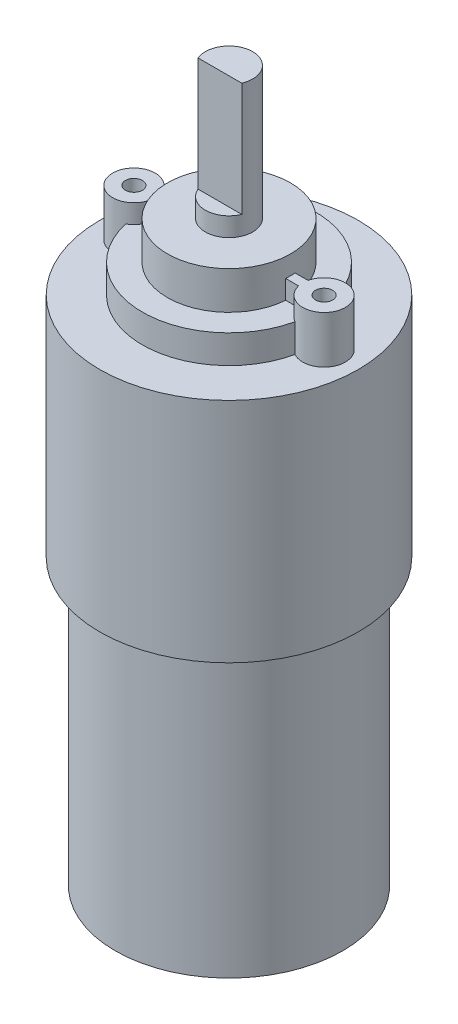
ISO-10303-21;
HEADER;
FILE_DESCRIPTION(('STEP AP214'),'2;1');
FILE_NAME('part.step','',(''),(''),'','','');
FILE_SCHEMA(('AUTOMOTIVE_DESIGN { 1 0 10303 214 1 1 1 1 }'));
ENDSEC;
DATA;
#1=APPLICATION_CONTEXT('core data for automotive mechanical design processes');
#2=APPLICATION_PROTOCOL_DEFINITION('international standard','automotive_design',2000,#1);
#3=PRODUCT_CONTEXT('',#1,'mechanical');
#4=PRODUCT('Part','Part','',(#3));
#5=PRODUCT_RELATED_PRODUCT_CATEGORY('part','',(#4));
#6=PRODUCT_DEFINITION_FORMATION('','',#4);
#7=PRODUCT_DEFINITION_CONTEXT('part definition',#1,'design');
#8=PRODUCT_DEFINITION('design','',#6,#7);
#9=PRODUCT_DEFINITION_SHAPE('','',#8);
#10=(LENGTH_UNIT() NAMED_UNIT(*) SI_UNIT(.MILLI.,.METRE.));
#11=(NAMED_UNIT(*) PLANE_ANGLE_UNIT() SI_UNIT($,.RADIAN.));
#12=(NAMED_UNIT(*) SI_UNIT($,.STERADIAN.) SOLID_ANGLE_UNIT());
#13=UNCERTAINTY_MEASURE_WITH_UNIT(LENGTH_MEASURE(1.E-05),#10,'distance_accuracy_value','');
#14=(GEOMETRIC_REPRESENTATION_CONTEXT(3) GLOBAL_UNCERTAINTY_ASSIGNED_CONTEXT((#13)) GLOBAL_UNIT_ASSIGNED_CONTEXT((#10,
#11,#12)) REPRESENTATION_CONTEXT('',''));
#15=CARTESIAN_POINT('',(0.,0.,0.));
#16=DIRECTION('',(0.,0.,1.));
#17=DIRECTION('',(1.,0.,0.));
#18=AXIS2_PLACEMENT_3D('',#15,#16,#17);
#19=CARTESIAN_POINT('',(0.,26.5,0.));
#20=DIRECTION('',(0.,1.,0.));
#21=DIRECTION('',(0.,0.,-1.));
#22=AXIS2_PLACEMENT_3D('',#19,#20,#21);
#23=PLANE('',#22);
#24=DIRECTION('',(1.,0.,0.));
#25=VECTOR('',#24,1.);
#26=CARTESIAN_POINT('',(0.,26.5,-0.500000000000004));
#27=LINE('',#26,#25);
#28=CARTESIAN_POINT('',(6.48074069840786,26.5,-0.500000000000004));
#29=VERTEX_POINT('',#28);
#30=CARTESIAN_POINT('',(7.84625890315197,26.5,-0.500000000000004));
#31=VERTEX_POINT('',#30);
#32=EDGE_CURVE('E306',#29,#31,#27,.T.);
#33=ORIENTED_EDGE('',*,*,#32,.T.);
#34=CARTESIAN_POINT('',(10.04,26.5,0.));
#35=DIRECTION('',(0.,-1.,0.));
#36=DIRECTION('',(0.,0.,-1.));
#37=AXIS2_PLACEMENT_3D('',#34,#35,#36);
#38=CIRCLE('',#37,2.25);
#39=CARTESIAN_POINT('',(8.93733067729083,26.5,-1.9612802871482));
#40=VERTEX_POINT('',#39);
#41=EDGE_CURVE('E174',#31,#40,#38,.T.);
#42=ORIENTED_EDGE('',*,*,#41,.T.);
#43=CARTESIAN_POINT('',(0.,26.5,0.));
#44=DIRECTION('',(0.,-1.,0.));
#45=DIRECTION('',(0.,0.,-1.));
#46=AXIS2_PLACEMENT_3D('',#43,#44,#45);
#47=CIRCLE('',#46,9.15);
#48=CARTESIAN_POINT('',(-8.93733067729084,26.5,-1.96128028714819));
#49=VERTEX_POINT('',#48);
#50=EDGE_CURVE('E273',#49,#40,#47,.T.);
#51=ORIENTED_EDGE('',*,*,#50,.F.);
#52=CARTESIAN_POINT('',(-10.04,26.5,0.));
#53=DIRECTION('',(0.,-1.,0.));
#54=DIRECTION('',(0.,0.,-1.));
#55=AXIS2_PLACEMENT_3D('',#52,#53,#54);
#56=CIRCLE('',#55,2.25);
#57=CARTESIAN_POINT('',(-7.84625890315197,26.5,-0.500000000000004));
#58=VERTEX_POINT('',#57);
#59=EDGE_CURVE('E216',#58,#49,#56,.F.);
#60=ORIENTED_EDGE('',*,*,#59,.F.);
#61=CARTESIAN_POINT('',(-6.48074069840786,26.5,-0.500000000000004));
#62=VERTEX_POINT('',#61);
#63=EDGE_CURVE('E303',#58,#62,#27,.T.);
#64=ORIENTED_EDGE('',*,*,#63,.T.);
#65=CARTESIAN_POINT('',(0.,26.5,0.));
#66=DIRECTION('',(0.,-1.,0.));
#67=DIRECTION('',(0.,0.,-1.));
#68=AXIS2_PLACEMENT_3D('',#65,#66,#67);
#69=CIRCLE('',#68,6.5);
#70=EDGE_CURVE('E278',#62,#29,#69,.T.);
#71=ORIENTED_EDGE('',*,*,#70,.T.);
#72=EDGE_LOOP('',(#33,#42,#51,#60,#64,#71));
#73=FACE_BOUND('',#72,.T.);
#74=ADVANCED_FACE('F39',(#73),#23,.T.);
#75=CARTESIAN_POINT('',(8.93733067729083,26.5,1.9612802871482));
#76=VERTEX_POINT('',#75);
#77=CARTESIAN_POINT('',(7.84625890315197,26.5,0.499999999999999));
#78=VERTEX_POINT('',#77);
#79=EDGE_CURVE('E233',#76,#78,#38,.T.);
#80=ORIENTED_EDGE('',*,*,#79,.T.);
#81=DIRECTION('',(1.,0.,0.));
#82=VECTOR('',#81,1.);
#83=CARTESIAN_POINT('',(0.,26.5,0.499999999999999));
#84=LINE('',#83,#82);
#85=CARTESIAN_POINT('',(6.48074069840786,26.5,0.499999999999999));
#86=VERTEX_POINT('',#85);
#87=EDGE_CURVE('E304',#86,#78,#84,.T.);
#88=ORIENTED_EDGE('',*,*,#87,.F.);
#89=CARTESIAN_POINT('',(-6.48074069840786,26.5,0.499999999999999));
#90=VERTEX_POINT('',#89);
#91=EDGE_CURVE('E281',#86,#90,#69,.T.);
#92=ORIENTED_EDGE('',*,*,#91,.T.);
#93=CARTESIAN_POINT('',(-7.84625890315197,26.5,0.499999999999999));
#94=VERTEX_POINT('',#93);
#95=EDGE_CURVE('E301',#94,#90,#84,.T.);
#96=ORIENTED_EDGE('',*,*,#95,.F.);
#97=CARTESIAN_POINT('',(-8.93733067729083,26.5,1.9612802871482));
#98=VERTEX_POINT('',#97);
#99=EDGE_CURVE('E212',#98,#94,#56,.F.);
#100=ORIENTED_EDGE('',*,*,#99,.F.);
#101=EDGE_CURVE('E327',#76,#98,#47,.T.);
#102=ORIENTED_EDGE('',*,*,#101,.F.);
#103=EDGE_LOOP('',(#80,#88,#92,#96,#100,#102));
#104=FACE_BOUND('',#103,.T.);
#105=ADVANCED_FACE('F324',(#104),#23,.T.);
#106=CARTESIAN_POINT('',(0.,65.6871565633395,0.));
#107=DIRECTION('',(0.,1.,0.));
#108=DIRECTION('',(0.,0.,-1.));
#109=AXIS2_PLACEMENT_3D('',#106,#107,#108);
#110=CYLINDRICAL_SURFACE('',#109,9.15);
#111=DIRECTION('',(0.,-1.,0.));
#112=VECTOR('',#111,1.);
#113=CARTESIAN_POINT('',(8.93733067729083,25.,1.9612802871482));
#114=LINE('',#113,#112);
#115=CARTESIAN_POINT('',(8.93733067729083,23.5,1.9612802871482));
#116=VERTEX_POINT('',#115);
#117=EDGE_CURVE('E232',#116,#76,#114,.F.);
#118=ORIENTED_EDGE('',*,*,#117,.T.);
#119=ORIENTED_EDGE('',*,*,#101,.T.);
#120=DIRECTION('',(0.,-1.,0.));
#121=VECTOR('',#120,1.);
#122=CARTESIAN_POINT('',(-8.93733067729083,25.,1.9612802871482));
#123=LINE('',#122,#121);
#124=CARTESIAN_POINT('',(-8.93733067729083,23.5,1.9612802871482));
#125=VERTEX_POINT('',#124);
#126=EDGE_CURVE('E210',#125,#98,#123,.F.);
#127=ORIENTED_EDGE('',*,*,#126,.F.);
#128=CARTESIAN_POINT('',(0.,23.5,0.));
#129=DIRECTION('',(0.,-1.,0.));
#130=DIRECTION('',(0.,0.,-1.));
#131=AXIS2_PLACEMENT_3D('',#128,#129,#130);
#132=CIRCLE('',#131,9.15);
#133=EDGE_CURVE('E333',#116,#125,#132,.T.);
#134=ORIENTED_EDGE('',*,*,#133,.F.);
#135=EDGE_LOOP('',(#118,#119,#127,#134));
#136=FACE_BOUND('',#135,.T.);
#137=ADVANCED_FACE('F330',(#136),#110,.T.);
#138=DIRECTION('',(0.,-1.,0.));
#139=VECTOR('',#138,1.);
#140=CARTESIAN_POINT('',(8.93733067729083,25.,-1.9612802871482));
#141=LINE('',#140,#139);
#142=CARTESIAN_POINT('',(8.93733067729083,23.5,-1.9612802871482));
#143=VERTEX_POINT('',#142);
#144=EDGE_CURVE('E228',#40,#143,#141,.T.);
#145=ORIENTED_EDGE('',*,*,#144,.T.);
#146=CARTESIAN_POINT('',(-8.93733067729083,23.5,-1.9612802871482));
#147=VERTEX_POINT('',#146);
#148=EDGE_CURVE('E268',#147,#143,#132,.T.);
#149=ORIENTED_EDGE('',*,*,#148,.F.);
#150=DIRECTION('',(0.,-1.,0.));
#151=VECTOR('',#150,1.);
#152=CARTESIAN_POINT('',(-8.93733067729083,25.,-1.9612802871482));
#153=LINE('',#152,#151);
#154=EDGE_CURVE('E215',#49,#147,#153,.T.);
#155=ORIENTED_EDGE('',*,*,#154,.F.);
#156=ORIENTED_EDGE('',*,*,#50,.T.);
#157=EDGE_LOOP('',(#145,#149,#155,#156));
#158=FACE_BOUND('',#157,.T.);
#159=ADVANCED_FACE('F372',(#158),#110,.T.);
#160=CARTESIAN_POINT('',(0.,23.5,0.));
#161=DIRECTION('',(0.,1.,0.));
#162=DIRECTION('',(0.,0.,-1.));
#163=AXIS2_PLACEMENT_3D('',#160,#161,#162);
#164=PLANE('',#163);
#165=CARTESIAN_POINT('',(0.,23.5,0.));
#166=DIRECTION('',(0.,-1.,0.));
#167=DIRECTION('',(0.,0.,-1.));
#168=AXIS2_PLACEMENT_3D('',#165,#166,#167);
#169=CIRCLE('',#168,13.65);
#170=CARTESIAN_POINT('',(0.,23.5,-13.65));
#171=VERTEX_POINT('',#170);
#172=EDGE_CURVE('E265',#171,#171,#169,.T.);
#173=ORIENTED_EDGE('',*,*,#172,.F.);
#174=EDGE_LOOP('',(#173));
#175=FACE_BOUND('',#174,.T.);
#176=CARTESIAN_POINT('',(10.04,23.5,0.));
#177=DIRECTION('',(0.,-1.,0.));
#178=DIRECTION('',(0.,0.,-1.));
#179=AXIS2_PLACEMENT_3D('',#176,#177,#178);
#180=CIRCLE('',#179,2.25);
#181=EDGE_CURVE('E299',#143,#116,#180,.T.);
#182=ORIENTED_EDGE('',*,*,#181,.T.);
#183=ORIENTED_EDGE('',*,*,#133,.T.);
#184=CARTESIAN_POINT('',(-10.04,23.5,0.));
#185=DIRECTION('',(0.,-1.,0.));
#186=DIRECTION('',(0.,0.,-1.));
#187=AXIS2_PLACEMENT_3D('',#184,#185,#186);
#188=CIRCLE('',#187,2.25);
#189=EDGE_CURVE('E294',#147,#125,#188,.F.);
#190=ORIENTED_EDGE('',*,*,#189,.F.);
#191=ORIENTED_EDGE('',*,*,#148,.T.);
#192=EDGE_LOOP('',(#182,#183,#190,#191));
#193=FACE_BOUND('',#192,.T.);
#194=ADVANCED_FACE('F362',(#175,#193),#164,.T.);
#195=CARTESIAN_POINT('',(0.,44.5,0.));
#196=DIRECTION('',(0.,1.,0.));
#197=DIRECTION('',(0.,0.,-1.));
#198=AXIS2_PLACEMENT_3D('',#195,#196,#197);
#199=PLANE('',#198);
#200=DIRECTION('',(1.,0.,0.));
#201=VECTOR('',#200,1.);
#202=CARTESIAN_POINT('',(0.,44.5,0.96));
#203=LINE('',#202,#201);
#204=CARTESIAN_POINT('',(-2.30833273164854,44.5,0.96));
#205=VERTEX_POINT('',#204);
#206=CARTESIAN_POINT('',(2.30833273164854,44.5,0.96));
#207=VERTEX_POINT('',#206);
#208=EDGE_CURVE('E244',#205,#207,#203,.T.);
#209=ORIENTED_EDGE('',*,*,#208,.T.);
#210=CARTESIAN_POINT('',(0.,44.5,0.));
#211=DIRECTION('',(0.,-1.,0.));
#212=DIRECTION('',(0.,0.,-1.));
#213=AXIS2_PLACEMENT_3D('',#210,#211,#212);
#214=CIRCLE('',#213,2.5);
#215=EDGE_CURVE('E288',#205,#207,#214,.T.);
#216=ORIENTED_EDGE('',*,*,#215,.F.);
#217=EDGE_LOOP('',(#209,#216));
#218=FACE_BOUND('',#217,.T.);
#219=ADVANCED_FACE('F41',(#218),#199,.T.);
#220=CARTESIAN_POINT('',(0.,65.6871565633395,0.));
#221=DIRECTION('',(0.,1.,0.));
#222=DIRECTION('',(0.,0.,-1.));
#223=AXIS2_PLACEMENT_3D('',#220,#221,#222);
#224=CYLINDRICAL_SURFACE('',#223,2.5);
#225=DIRECTION('',(0.,1.,0.));
#226=VECTOR('',#225,1.);
#227=CARTESIAN_POINT('',(2.30833273164854,32.5,0.96));
#228=LINE('',#227,#226);
#229=CARTESIAN_POINT('',(2.30833273164854,32.5,0.96));
#230=VERTEX_POINT('',#229);
#231=EDGE_CURVE('E253',#230,#207,#228,.T.);
#232=ORIENTED_EDGE('',*,*,#231,.F.);
#233=CARTESIAN_POINT('',(0.,32.5,0.));
#234=DIRECTION('',(0.,-1.,0.));
#235=DIRECTION('',(0.,0.,-1.));
#236=AXIS2_PLACEMENT_3D('',#233,#234,#235);
#237=CIRCLE('',#236,2.5);
#238=CARTESIAN_POINT('',(-2.30833273164854,32.5,0.96));
#239=VERTEX_POINT('',#238);
#240=EDGE_CURVE('E245',#230,#239,#237,.T.);
#241=ORIENTED_EDGE('',*,*,#240,.T.);
#242=DIRECTION('',(0.,1.,0.));
#243=VECTOR('',#242,1.);
#244=CARTESIAN_POINT('',(-2.30833273164854,32.5,0.96));
#245=LINE('',#244,#243);
#246=EDGE_CURVE('E250',#239,#205,#245,.T.);
#247=ORIENTED_EDGE('',*,*,#246,.T.);
#248=ORIENTED_EDGE('',*,*,#215,.T.);
#249=EDGE_LOOP('',(#232,#241,#247,#248));
#250=FACE_BOUND('',#249,.T.);
#251=CARTESIAN_POINT('',(0.,30.5,0.));
#252=DIRECTION('',(0.,-1.,0.));
#253=DIRECTION('',(0.,0.,-1.));
#254=AXIS2_PLACEMENT_3D('',#251,#252,#253);
#255=CIRCLE('',#254,2.5);
#256=CARTESIAN_POINT('',(0.,30.5,-2.5));
#257=VERTEX_POINT('',#256);
#258=EDGE_CURVE('E285',#257,#257,#255,.T.);
#259=ORIENTED_EDGE('',*,*,#258,.F.);
#260=EDGE_LOOP('',(#259));
#261=FACE_BOUND('',#260,.T.);
#262=ADVANCED_FACE('F575',(#250,#261),#224,.T.);
#263=CARTESIAN_POINT('',(0.,30.5,0.));
#264=DIRECTION('',(0.,1.,0.));
#265=DIRECTION('',(0.,0.,-1.));
#266=AXIS2_PLACEMENT_3D('',#263,#264,#265);
#267=PLANE('',#266);
#268=CARTESIAN_POINT('',(0.,30.5,0.));
#269=DIRECTION('',(0.,-1.,0.));
#270=DIRECTION('',(0.,0.,-1.));
#271=AXIS2_PLACEMENT_3D('',#268,#269,#270);
#272=CIRCLE('',#271,6.5);
#273=CARTESIAN_POINT('',(0.,30.5,-6.5));
#274=VERTEX_POINT('',#273);
#275=EDGE_CURVE('E282',#274,#274,#272,.T.);
#276=ORIENTED_EDGE('',*,*,#275,.F.);
#277=EDGE_LOOP('',(#276));
#278=FACE_BOUND('',#277,.T.);
#279=ORIENTED_EDGE('',*,*,#258,.T.);
#280=EDGE_LOOP('',(#279));
#281=FACE_BOUND('',#280,.T.);
#282=ADVANCED_FACE('F567',(#278,#281),#267,.T.);
#283=CARTESIAN_POINT('',(0.,65.6871565633395,0.));
#284=DIRECTION('',(0.,1.,0.));
#285=DIRECTION('',(0.,0.,-1.));
#286=AXIS2_PLACEMENT_3D('',#283,#284,#285);
#287=CYLINDRICAL_SURFACE('',#286,6.5);
#288=DIRECTION('',(0.,1.,0.));
#289=VECTOR('',#288,1.);
#290=CARTESIAN_POINT('',(-6.48074069840786,65.6871565633395,-0.500000000000004));
#291=LINE('',#290,#289);
#292=CARTESIAN_POINT('',(-6.48074069840786,28.5,-0.500000000000004));
#293=VERTEX_POINT('',#292);
#294=EDGE_CURVE('E241',#62,#293,#291,.T.);
#295=ORIENTED_EDGE('',*,*,#294,.T.);
#296=CARTESIAN_POINT('',(0.,28.5,0.));
#297=DIRECTION('',(0.,-1.,0.));
#298=DIRECTION('',(0.,0.,-1.));
#299=AXIS2_PLACEMENT_3D('',#296,#297,#298);
#300=CIRCLE('',#299,6.5);
#301=CARTESIAN_POINT('',(-6.48074069840786,28.5,0.499999999999999));
#302=VERTEX_POINT('',#301);
#303=EDGE_CURVE('E11',#293,#302,#300,.F.);
#304=ORIENTED_EDGE('',*,*,#303,.T.);
#305=DIRECTION('',(0.,1.,0.));
#306=VECTOR('',#305,1.);
#307=CARTESIAN_POINT('',(-6.48074069840786,65.6871565633395,0.499999999999999));
#308=LINE('',#307,#306);
#309=EDGE_CURVE('E237',#90,#302,#308,.T.);
#310=ORIENTED_EDGE('',*,*,#309,.F.);
#311=ORIENTED_EDGE('',*,*,#91,.F.);
#312=DIRECTION('',(0.,1.,0.));
#313=VECTOR('',#312,1.);
#314=CARTESIAN_POINT('',(6.48074069840786,65.6871565633395,0.499999999999999));
#315=LINE('',#314,#313);
#316=CARTESIAN_POINT('',(6.48074069840786,28.5,0.499999999999999));
#317=VERTEX_POINT('',#316);
#318=EDGE_CURVE('E235',#317,#86,#315,.F.);
#319=ORIENTED_EDGE('',*,*,#318,.F.);
#320=CARTESIAN_POINT('',(6.48074069840786,28.5,-0.500000000000004));
#321=VERTEX_POINT('',#320);
#322=EDGE_CURVE('E43',#317,#321,#300,.F.);
#323=ORIENTED_EDGE('',*,*,#322,.T.);
#324=DIRECTION('',(0.,1.,0.));
#325=VECTOR('',#324,1.);
#326=CARTESIAN_POINT('',(6.48074069840786,65.6871565633395,-0.500000000000004));
#327=LINE('',#326,#325);
#328=EDGE_CURVE('E182',#321,#29,#327,.F.);
#329=ORIENTED_EDGE('',*,*,#328,.T.);
#330=ORIENTED_EDGE('',*,*,#70,.F.);
#331=EDGE_LOOP('',(#295,#304,#310,#311,#319,#323,#329,#330));
#332=FACE_BOUND('',#331,.T.);
#333=ORIENTED_EDGE('',*,*,#275,.T.);
#334=EDGE_LOOP('',(#333));
#335=FACE_BOUND('',#334,.T.);
#336=ADVANCED_FACE('F313',(#332,#335),#287,.T.);
#337=CARTESIAN_POINT('',(0.,65.6871565633395,0.));
#338=DIRECTION('',(0.,1.,0.));
#339=DIRECTION('',(0.,0.,-1.));
#340=AXIS2_PLACEMENT_3D('',#337,#338,#339);
#341=CYLINDRICAL_SURFACE('',#340,13.65);
#342=CARTESIAN_POINT('',(0.,-0.5,0.));
#343=DIRECTION('',(0.,-1.,0.));
#344=DIRECTION('',(0.,0.,-1.));
#345=AXIS2_PLACEMENT_3D('',#342,#343,#344);
#346=CIRCLE('',#345,13.65);
#347=CARTESIAN_POINT('',(0.,-0.5,-13.65));
#348=VERTEX_POINT('',#347);
#349=EDGE_CURVE('E262',#348,#348,#346,.T.);
#350=ORIENTED_EDGE('',*,*,#349,.F.);
#351=EDGE_LOOP('',(#350));
#352=FACE_BOUND('',#351,.T.);
#353=ORIENTED_EDGE('',*,*,#172,.T.);
#354=EDGE_LOOP('',(#353));
#355=FACE_BOUND('',#354,.T.);
#356=ADVANCED_FACE('F549',(#352,#355),#341,.T.);
#357=CARTESIAN_POINT('',(0.,-0.5,0.));
#358=DIRECTION('',(0.,-1.,0.));
#359=DIRECTION('',(0.,0.,1.));
#360=AXIS2_PLACEMENT_3D('',#357,#358,#359);
#361=PLANE('',#360);
#362=CARTESIAN_POINT('',(0.,-0.5,0.));
#363=DIRECTION('',(0.,-1.,0.));
#364=DIRECTION('',(0.,0.,-1.));
#365=AXIS2_PLACEMENT_3D('',#362,#363,#364);
#366=CIRCLE('',#365,12.);
#367=CARTESIAN_POINT('',(0.,-0.5,-12.));
#368=VERTEX_POINT('',#367);
#369=EDGE_CURVE('E259',#368,#368,#366,.T.);
#370=ORIENTED_EDGE('',*,*,#369,.F.);
#371=EDGE_LOOP('',(#370));
#372=FACE_BOUND('',#371,.T.);
#373=ORIENTED_EDGE('',*,*,#349,.T.);
#374=EDGE_LOOP('',(#373));
#375=FACE_BOUND('',#374,.T.);
#376=ADVANCED_FACE('F539',(#372,#375),#361,.T.);
#377=CARTESIAN_POINT('',(0.,65.6871565633395,0.));
#378=DIRECTION('',(0.,1.,0.));
#379=DIRECTION('',(0.,0.,-1.));
#380=AXIS2_PLACEMENT_3D('',#377,#378,#379);
#381=CYLINDRICAL_SURFACE('',#380,12.);
#382=CARTESIAN_POINT('',(0.,-30.5,0.));
#383=DIRECTION('',(0.,-1.,0.));
#384=DIRECTION('',(0.,0.,-1.));
#385=AXIS2_PLACEMENT_3D('',#382,#383,#384);
#386=CIRCLE('',#385,12.);
#387=CARTESIAN_POINT('',(0.,-30.5,-12.));
#388=VERTEX_POINT('',#387);
#389=EDGE_CURVE('E255',#388,#388,#386,.T.);
#390=ORIENTED_EDGE('',*,*,#389,.F.);
#391=EDGE_LOOP('',(#390));
#392=FACE_BOUND('',#391,.T.);
#393=ORIENTED_EDGE('',*,*,#369,.T.);
#394=EDGE_LOOP('',(#393));
#395=FACE_BOUND('',#394,.T.);
#396=ADVANCED_FACE('F529',(#392,#395),#381,.T.);
#397=CARTESIAN_POINT('',(0.,-30.5,0.));
#398=DIRECTION('',(0.,-1.,0.));
#399=DIRECTION('',(0.,0.,1.));
#400=AXIS2_PLACEMENT_3D('',#397,#398,#399);
#401=PLANE('',#400);
#402=ORIENTED_EDGE('',*,*,#389,.T.);
#403=EDGE_LOOP('',(#402));
#404=FACE_BOUND('',#403,.T.);
#405=ADVANCED_FACE('F519',(#404),#401,.T.);
#406=CARTESIAN_POINT('',(0.,32.5,0.96));
#407=DIRECTION('',(0.,0.,-1.));
#408=DIRECTION('',(1.,0.,0.));
#409=AXIS2_PLACEMENT_3D('',#406,#407,#408);
#410=PLANE('',#409);
#411=ORIENTED_EDGE('',*,*,#208,.F.);
#412=ORIENTED_EDGE('',*,*,#246,.F.);
#413=DIRECTION('',(1.,0.,0.));
#414=VECTOR('',#413,1.);
#415=CARTESIAN_POINT('',(0.,32.5,0.96));
#416=LINE('',#415,#414);
#417=EDGE_CURVE('E248',#239,#230,#416,.T.);
#418=ORIENTED_EDGE('',*,*,#417,.T.);
#419=ORIENTED_EDGE('',*,*,#231,.T.);
#420=EDGE_LOOP('',(#411,#412,#418,#419));
#421=FACE_BOUND('',#420,.T.);
#422=ADVANCED_FACE('F509',(#421),#410,.F.);
#423=CARTESIAN_POINT('',(0.,32.5,0.));
#424=DIRECTION('',(0.,1.,0.));
#425=DIRECTION('',(0.,0.,-1.));
#426=AXIS2_PLACEMENT_3D('',#423,#424,#425);
#427=PLANE('',#426);
#428=ORIENTED_EDGE('',*,*,#240,.F.);
#429=ORIENTED_EDGE('',*,*,#417,.F.);
#430=EDGE_LOOP('',(#428,#429));
#431=FACE_BOUND('',#430,.T.);
#432=ADVANCED_FACE('F499',(#431),#427,.T.);
#433=CARTESIAN_POINT('',(-10.04,28.5,0.));
#434=DIRECTION('',(0.,-1.,0.));
#435=DIRECTION('',(0.,0.,1.));
#436=AXIS2_PLACEMENT_3D('',#433,#434,#435);
#437=CYLINDRICAL_SURFACE('',#436,2.25);
#438=ORIENTED_EDGE('',*,*,#59,.T.);
#439=ORIENTED_EDGE('',*,*,#154,.T.);
#440=ORIENTED_EDGE('',*,*,#189,.T.);
#441=ORIENTED_EDGE('',*,*,#126,.T.);
#442=ORIENTED_EDGE('',*,*,#99,.T.);
#443=DIRECTION('',(0.,-1.,0.));
#444=VECTOR('',#443,1.);
#445=CARTESIAN_POINT('',(-7.84625890315197,28.5,0.499999999999999));
#446=LINE('',#445,#444);
#447=CARTESIAN_POINT('',(-7.84625890315197,28.5,0.499999999999999));
#448=VERTEX_POINT('',#447);
#449=EDGE_CURVE('E199',#448,#94,#446,.T.);
#450=ORIENTED_EDGE('',*,*,#449,.F.);
#451=CARTESIAN_POINT('',(-10.04,28.5,0.));
#452=DIRECTION('',(0.,-1.,0.));
#453=DIRECTION('',(0.,0.,-1.));
#454=AXIS2_PLACEMENT_3D('',#451,#452,#453);
#455=CIRCLE('',#454,2.25);
#456=CARTESIAN_POINT('',(-7.84625890315197,28.5,-0.500000000000004));
#457=VERTEX_POINT('',#456);
#458=EDGE_CURVE('E188',#448,#457,#455,.T.);
#459=ORIENTED_EDGE('',*,*,#458,.T.);
#460=DIRECTION('',(0.,-1.,0.));
#461=VECTOR('',#460,1.);
#462=CARTESIAN_POINT('',(-7.84625890315197,28.5,-0.500000000000004));
#463=LINE('',#462,#461);
#464=EDGE_CURVE('E197',#457,#58,#463,.T.);
#465=ORIENTED_EDGE('',*,*,#464,.T.);
#466=EDGE_LOOP('',(#438,#439,#440,#441,#442,#450,#459,#465));
#467=FACE_BOUND('',#466,.T.);
#468=ADVANCED_FACE('F490',(#467),#437,.T.);
#469=CARTESIAN_POINT('',(0.,28.5,0.499999999999999));
#470=DIRECTION('',(0.,0.,-1.));
#471=DIRECTION('',(1.,0.,0.));
#472=AXIS2_PLACEMENT_3D('',#469,#470,#471);
#473=PLANE('',#472);
#474=ORIENTED_EDGE('',*,*,#309,.T.);
#475=DIRECTION('',(-1.,0.,0.));
#476=VECTOR('',#475,1.);
#477=CARTESIAN_POINT('',(0.,28.5,0.499999999999999));
#478=LINE('',#477,#476);
#479=EDGE_CURVE('E167',#302,#448,#478,.T.);
#480=ORIENTED_EDGE('',*,*,#479,.T.);
#481=ORIENTED_EDGE('',*,*,#449,.T.);
#482=ORIENTED_EDGE('',*,*,#95,.T.);
#483=EDGE_LOOP('',(#474,#480,#481,#482));
#484=FACE_BOUND('',#483,.T.);
#485=ADVANCED_FACE('F425',(#484),#473,.F.);
#486=CARTESIAN_POINT('',(0.,28.5,-0.500000000000004));
#487=DIRECTION('',(0.,0.,-1.));
#488=DIRECTION('',(1.,0.,0.));
#489=AXIS2_PLACEMENT_3D('',#486,#487,#488);
#490=PLANE('',#489);
#491=ORIENTED_EDGE('',*,*,#63,.F.);
#492=ORIENTED_EDGE('',*,*,#464,.F.);
#493=DIRECTION('',(-1.,0.,0.));
#494=VECTOR('',#493,1.);
#495=CARTESIAN_POINT('',(0.,28.5,-0.500000000000004));
#496=LINE('',#495,#494);
#497=EDGE_CURVE('E184',#293,#457,#496,.T.);
#498=ORIENTED_EDGE('',*,*,#497,.F.);
#499=ORIENTED_EDGE('',*,*,#294,.F.);
#500=EDGE_LOOP('',(#491,#492,#498,#499));
#501=FACE_BOUND('',#500,.T.);
#502=ADVANCED_FACE('F387',(#501),#490,.T.);
#503=CARTESIAN_POINT('',(-10.04,28.5,0.));
#504=DIRECTION('',(0.,-1.,0.));
#505=DIRECTION('',(0.,0.,1.));
#506=AXIS2_PLACEMENT_3D('',#503,#504,#505);
#507=CYLINDRICAL_SURFACE('',#506,0.9);
#508=CARTESIAN_POINT('',(-10.04,28.5,0.));
#509=DIRECTION('',(0.,-1.,0.));
#510=DIRECTION('',(0.,0.,-1.));
#511=AXIS2_PLACEMENT_3D('',#508,#509,#510);
#512=CIRCLE('',#511,0.9);
#513=CARTESIAN_POINT('',(-10.04,28.5,-0.900000000000001));
#514=VERTEX_POINT('',#513);
#515=EDGE_CURVE('E194',#514,#514,#512,.T.);
#516=ORIENTED_EDGE('',*,*,#515,.F.);
#517=EDGE_LOOP('',(#516));
#518=FACE_BOUND('',#517,.T.);
#519=CARTESIAN_POINT('',(-10.04,26.5,0.));
#520=DIRECTION('',(0.,-1.,0.));
#521=DIRECTION('',(0.,0.,-1.));
#522=AXIS2_PLACEMENT_3D('',#519,#520,#521);
#523=CIRCLE('',#522,0.9);
#524=CARTESIAN_POINT('',(-9.14910856573705,26.5,0.12772021123107));
#525=VERTEX_POINT('',#524);
#526=CARTESIAN_POINT('',(-9.14910856573705,26.5,-0.127720211231075));
#527=VERTEX_POINT('',#526);
#528=EDGE_CURVE('E204',#525,#527,#523,.F.);
#529=ORIENTED_EDGE('',*,*,#528,.F.);
#530=DIRECTION('',(0.,-1.,0.));
#531=VECTOR('',#530,1.);
#532=CARTESIAN_POINT('',(-9.14910856573705,26.,0.127720211231072));
#533=LINE('',#532,#531);
#534=CARTESIAN_POINT('',(-9.14910856573705,23.5,0.127720211231072));
#535=VERTEX_POINT('',#534);
#536=EDGE_CURVE('E178',#535,#525,#533,.F.);
#537=ORIENTED_EDGE('',*,*,#536,.F.);
#538=CARTESIAN_POINT('',(-10.04,23.5,0.));
#539=DIRECTION('',(0.,-1.,0.));
#540=DIRECTION('',(0.,0.,-1.));
#541=AXIS2_PLACEMENT_3D('',#538,#539,#540);
#542=CIRCLE('',#541,0.9);
#543=CARTESIAN_POINT('',(-9.14910856573705,23.5,-0.127720211231075));
#544=VERTEX_POINT('',#543);
#545=EDGE_CURVE('E291',#544,#535,#542,.F.);
#546=ORIENTED_EDGE('',*,*,#545,.F.);
#547=DIRECTION('',(0.,-1.,0.));
#548=VECTOR('',#547,1.);
#549=CARTESIAN_POINT('',(-9.14910856573705,26.,-0.127720211231075));
#550=LINE('',#549,#548);
#551=EDGE_CURVE('E207',#527,#544,#550,.T.);
#552=ORIENTED_EDGE('',*,*,#551,.F.);
#553=EDGE_LOOP('',(#529,#537,#546,#552));
#554=FACE_BOUND('',#553,.T.);
#555=ADVANCED_FACE('F344',(#518,#554),#507,.F.);
#556=CARTESIAN_POINT('',(0.,28.5,0.));
#557=DIRECTION('',(0.,1.,0.));
#558=DIRECTION('',(0.,0.,-1.));
#559=AXIS2_PLACEMENT_3D('',#556,#557,#558);
#560=PLANE('',#559);
#561=ORIENTED_EDGE('',*,*,#515,.T.);
#562=EDGE_LOOP('',(#561));
#563=FACE_BOUND('',#562,.T.);
#564=ORIENTED_EDGE('',*,*,#497,.T.);
#565=ORIENTED_EDGE('',*,*,#458,.F.);
#566=ORIENTED_EDGE('',*,*,#479,.F.);
#567=ORIENTED_EDGE('',*,*,#303,.F.);
#568=EDGE_LOOP('',(#564,#565,#566,#567));
#569=FACE_BOUND('',#568,.T.);
#570=ADVANCED_FACE('F369',(#563,#569),#560,.T.);
#571=ORIENTED_EDGE('',*,*,#545,.T.);
#572=EDGE_CURVE('E271',#535,#544,#132,.T.);
#573=ORIENTED_EDGE('',*,*,#572,.T.);
#574=EDGE_LOOP('',(#571,#573));
#575=FACE_BOUND('',#574,.T.);
#576=ADVANCED_FACE('F336',(#575),#164,.T.);
#577=ORIENTED_EDGE('',*,*,#551,.T.);
#578=ORIENTED_EDGE('',*,*,#572,.F.);
#579=ORIENTED_EDGE('',*,*,#536,.T.);
#580=EDGE_CURVE('E276',#525,#527,#47,.T.);
#581=ORIENTED_EDGE('',*,*,#580,.T.);
#582=EDGE_LOOP('',(#577,#578,#579,#581));
#583=FACE_BOUND('',#582,.T.);
#584=ADVANCED_FACE('F341',(#583),#110,.T.);
#585=ORIENTED_EDGE('',*,*,#528,.T.);
#586=ORIENTED_EDGE('',*,*,#580,.F.);
#587=EDGE_LOOP('',(#585,#586));
#588=FACE_BOUND('',#587,.T.);
#589=ADVANCED_FACE('F346',(#588),#23,.T.);
#590=CARTESIAN_POINT('',(7.84625890315197,28.5,-0.500000000000004));
#591=VERTEX_POINT('',#590);
#592=EDGE_CURVE('E54',#591,#321,#496,.T.);
#593=ORIENTED_EDGE('',*,*,#592,.F.);
#594=DIRECTION('',(0.,-1.,0.));
#595=VECTOR('',#594,1.);
#596=CARTESIAN_POINT('',(7.84625890315197,28.5,-0.500000000000004));
#597=LINE('',#596,#595);
#598=EDGE_CURVE('E170',#591,#31,#597,.T.);
#599=ORIENTED_EDGE('',*,*,#598,.T.);
#600=ORIENTED_EDGE('',*,*,#32,.F.);
#601=ORIENTED_EDGE('',*,*,#328,.F.);
#602=EDGE_LOOP('',(#593,#599,#600,#601));
#603=FACE_BOUND('',#602,.T.);
#604=ADVANCED_FACE('F181',(#603),#490,.T.);
#605=CARTESIAN_POINT('',(10.04,28.5,0.));
#606=DIRECTION('',(0.,-1.,0.));
#607=DIRECTION('',(0.,0.,1.));
#608=AXIS2_PLACEMENT_3D('',#605,#606,#607);
#609=CYLINDRICAL_SURFACE('',#608,2.25);
#610=ORIENTED_EDGE('',*,*,#117,.F.);
#611=ORIENTED_EDGE('',*,*,#181,.F.);
#612=ORIENTED_EDGE('',*,*,#144,.F.);
#613=ORIENTED_EDGE('',*,*,#41,.F.);
#614=ORIENTED_EDGE('',*,*,#598,.F.);
#615=CARTESIAN_POINT('',(10.04,28.5,0.));
#616=DIRECTION('',(0.,-1.,0.));
#617=DIRECTION('',(0.,0.,-1.));
#618=AXIS2_PLACEMENT_3D('',#615,#616,#617);
#619=CIRCLE('',#618,2.25);
#620=CARTESIAN_POINT('',(7.84625890315197,28.5,0.499999999999999));
#621=VERTEX_POINT('',#620);
#622=EDGE_CURVE('E162',#621,#591,#619,.F.);
#623=ORIENTED_EDGE('',*,*,#622,.F.);
#624=DIRECTION('',(0.,-1.,0.));
#625=VECTOR('',#624,1.);
#626=CARTESIAN_POINT('',(7.84625890315197,28.5,0.499999999999999));
#627=LINE('',#626,#625);
#628=EDGE_CURVE('E179',#621,#78,#627,.T.);
#629=ORIENTED_EDGE('',*,*,#628,.T.);
#630=ORIENTED_EDGE('',*,*,#79,.F.);
#631=EDGE_LOOP('',(#610,#611,#612,#613,#614,#623,#629,#630));
#632=FACE_BOUND('',#631,.T.);
#633=ADVANCED_FACE('F172',(#632),#609,.T.);
#634=ORIENTED_EDGE('',*,*,#318,.T.);
#635=ORIENTED_EDGE('',*,*,#87,.T.);
#636=ORIENTED_EDGE('',*,*,#628,.F.);
#637=EDGE_CURVE('E62',#621,#317,#478,.T.);
#638=ORIENTED_EDGE('',*,*,#637,.T.);
#639=EDGE_LOOP('',(#634,#635,#636,#638));
#640=FACE_BOUND('',#639,.T.);
#641=ADVANCED_FACE('F319',(#640),#473,.F.);
#642=CARTESIAN_POINT('',(10.04,28.5,0.));
#643=DIRECTION('',(0.,-1.,0.));
#644=DIRECTION('',(0.,0.,1.));
#645=AXIS2_PLACEMENT_3D('',#642,#643,#644);
#646=CYLINDRICAL_SURFACE('',#645,0.9);
#647=DIRECTION('',(0.,-1.,0.));
#648=VECTOR('',#647,1.);
#649=CARTESIAN_POINT('',(9.14910856573705,26.,0.127720211231072));
#650=LINE('',#649,#648);
#651=CARTESIAN_POINT('',(9.14910856573705,23.5,0.127720211231072));
#652=VERTEX_POINT('',#651);
#653=CARTESIAN_POINT('',(9.14910856573705,26.5,0.127720211231072));
#654=VERTEX_POINT('',#653);
#655=EDGE_CURVE('E225',#652,#654,#650,.F.);
#656=ORIENTED_EDGE('',*,*,#655,.T.);
#657=CARTESIAN_POINT('',(10.04,26.5,0.));
#658=DIRECTION('',(0.,-1.,0.));
#659=DIRECTION('',(0.,0.,-1.));
#660=AXIS2_PLACEMENT_3D('',#657,#658,#659);
#661=CIRCLE('',#660,0.9);
#662=CARTESIAN_POINT('',(9.14910856573705,26.5,-0.127720211231075));
#663=VERTEX_POINT('',#662);
#664=EDGE_CURVE('E222',#654,#663,#661,.T.);
#665=ORIENTED_EDGE('',*,*,#664,.T.);
#666=DIRECTION('',(0.,-1.,0.));
#667=VECTOR('',#666,1.);
#668=CARTESIAN_POINT('',(9.14910856573705,26.,-0.127720211231075));
#669=LINE('',#668,#667);
#670=CARTESIAN_POINT('',(9.14910856573705,23.5,-0.127720211231075));
#671=VERTEX_POINT('',#670);
#672=EDGE_CURVE('E219',#663,#671,#669,.T.);
#673=ORIENTED_EDGE('',*,*,#672,.T.);
#674=CARTESIAN_POINT('',(10.04,23.5,0.));
#675=DIRECTION('',(0.,-1.,0.));
#676=DIRECTION('',(0.,0.,-1.));
#677=AXIS2_PLACEMENT_3D('',#674,#675,#676);
#678=CIRCLE('',#677,0.9);
#679=EDGE_CURVE('E296',#671,#652,#678,.T.);
#680=ORIENTED_EDGE('',*,*,#679,.T.);
#681=EDGE_LOOP('',(#656,#665,#673,#680));
#682=FACE_BOUND('',#681,.T.);
#683=CARTESIAN_POINT('',(10.04,28.5,0.));
#684=DIRECTION('',(0.,-1.,0.));
#685=DIRECTION('',(0.,0.,-1.));
#686=AXIS2_PLACEMENT_3D('',#683,#684,#685);
#687=CIRCLE('',#686,0.9);
#688=CARTESIAN_POINT('',(10.04,28.5,-0.900000000000001));
#689=VERTEX_POINT('',#688);
#690=EDGE_CURVE('E191',#689,#689,#687,.F.);
#691=ORIENTED_EDGE('',*,*,#690,.T.);
#692=EDGE_LOOP('',(#691));
#693=FACE_BOUND('',#692,.T.);
#694=ADVANCED_FACE('F355',(#682,#693),#646,.F.);
#695=ORIENTED_EDGE('',*,*,#637,.F.);
#696=ORIENTED_EDGE('',*,*,#622,.T.);
#697=ORIENTED_EDGE('',*,*,#592,.T.);
#698=ORIENTED_EDGE('',*,*,#322,.F.);
#699=EDGE_LOOP('',(#695,#696,#697,#698));
#700=FACE_BOUND('',#699,.T.);
#701=ORIENTED_EDGE('',*,*,#690,.F.);
#702=EDGE_LOOP('',(#701));
#703=FACE_BOUND('',#702,.T.);
#704=ADVANCED_FACE('F164',(#700,#703),#560,.T.);
#705=EDGE_CURVE('E272',#671,#652,#132,.T.);
#706=ORIENTED_EDGE('',*,*,#705,.T.);
#707=ORIENTED_EDGE('',*,*,#679,.F.);
#708=EDGE_LOOP('',(#706,#707));
#709=FACE_BOUND('',#708,.T.);
#710=ADVANCED_FACE('F359',(#709),#164,.T.);
#711=ORIENTED_EDGE('',*,*,#705,.F.);
#712=ORIENTED_EDGE('',*,*,#672,.F.);
#713=EDGE_CURVE('E277',#663,#654,#47,.T.);
#714=ORIENTED_EDGE('',*,*,#713,.T.);
#715=ORIENTED_EDGE('',*,*,#655,.F.);
#716=EDGE_LOOP('',(#711,#712,#714,#715));
#717=FACE_BOUND('',#716,.T.);
#718=ADVANCED_FACE('F351',(#717),#110,.T.);
#719=ORIENTED_EDGE('',*,*,#713,.F.);
#720=ORIENTED_EDGE('',*,*,#664,.F.);
#721=EDGE_LOOP('',(#719,#720));
#722=FACE_BOUND('',#721,.T.);
#723=ADVANCED_FACE('F353',(#722),#23,.T.);
#724=CLOSED_SHELL('',(#74,#105,#137,#159,#194,#219,#262,#282,#336,#356,#376,#396,#405,#422,#432,
#468,#485,#502,#555,#570,#576,#584,#589,#604,#633,#641,#694,#704,#710,#718,#723));
#725=MANIFOLD_SOLID_BREP('B2',#724);
#726=ADVANCED_BREP_SHAPE_REPRESENTATION('',(#18,#725),#14);
#727=SHAPE_DEFINITION_REPRESENTATION(#9,#726);
ENDSEC;
END-ISO-10303-21;
